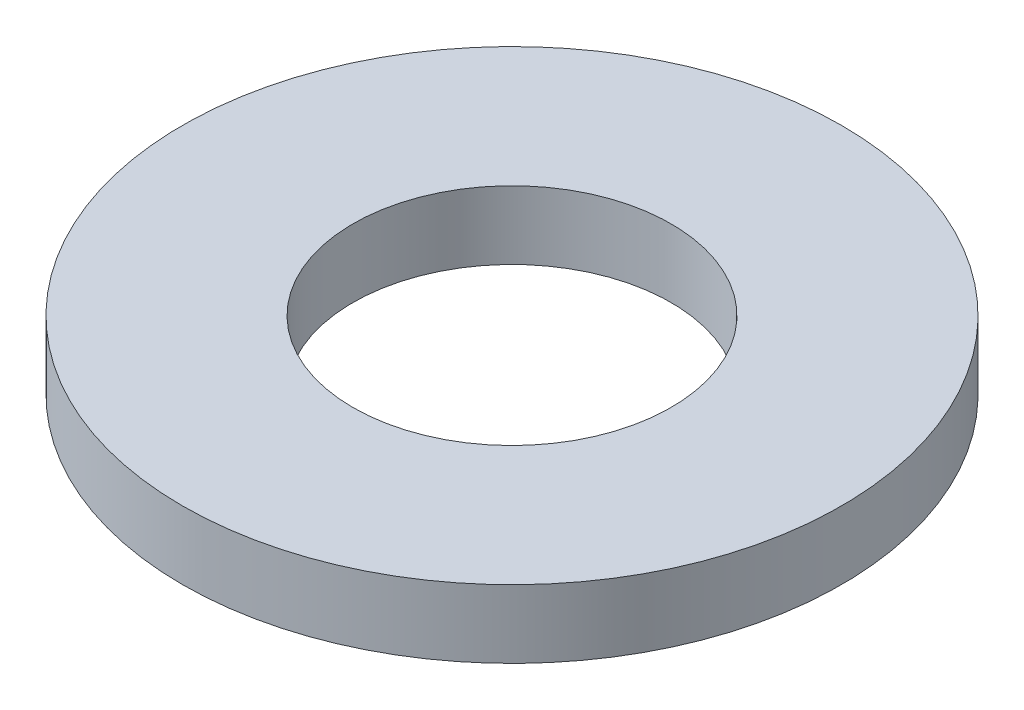
ISO-10303-21;
HEADER;
FILE_DESCRIPTION(('STEP AP214'),'2;1');
FILE_NAME('part.step','',(''),(''),'','','');
FILE_SCHEMA(('AUTOMOTIVE_DESIGN { 1 0 10303 214 1 1 1 1 }'));
ENDSEC;
DATA;
#1=APPLICATION_CONTEXT('core data for automotive mechanical design processes');
#2=APPLICATION_PROTOCOL_DEFINITION('international standard','automotive_design',2000,#1);
#3=PRODUCT_CONTEXT('',#1,'mechanical');
#4=PRODUCT('Part','Part','',(#3));
#5=PRODUCT_RELATED_PRODUCT_CATEGORY('part','',(#4));
#6=PRODUCT_DEFINITION_FORMATION('','',#4);
#7=PRODUCT_DEFINITION_CONTEXT('part definition',#1,'design');
#8=PRODUCT_DEFINITION('design','',#6,#7);
#9=PRODUCT_DEFINITION_SHAPE('','',#8);
#10=(LENGTH_UNIT() NAMED_UNIT(*) SI_UNIT(.MILLI.,.METRE.));
#11=(NAMED_UNIT(*) PLANE_ANGLE_UNIT() SI_UNIT($,.RADIAN.));
#12=(NAMED_UNIT(*) SI_UNIT($,.STERADIAN.) SOLID_ANGLE_UNIT());
#13=UNCERTAINTY_MEASURE_WITH_UNIT(LENGTH_MEASURE(1.E-05),#10,'distance_accuracy_value','');
#14=(GEOMETRIC_REPRESENTATION_CONTEXT(3) GLOBAL_UNCERTAINTY_ASSIGNED_CONTEXT((#13)) GLOBAL_UNIT_ASSIGNED_CONTEXT((#10,
#11,#12)) REPRESENTATION_CONTEXT('',''));
#15=CARTESIAN_POINT('',(0.,0.,0.));
#16=DIRECTION('',(0.,0.,1.));
#17=DIRECTION('',(1.,0.,0.));
#18=AXIS2_PLACEMENT_3D('',#15,#16,#17);
#19=CARTESIAN_POINT('',(0.,15.,0.));
#20=DIRECTION('',(0.,-1.,0.));
#21=DIRECTION('',(0.,0.,-1.));
#22=AXIS2_PLACEMENT_3D('',#19,#20,#21);
#23=CYLINDRICAL_SURFACE('',#22,72.5);
#24=CARTESIAN_POINT('',(0.,15.,0.));
#25=DIRECTION('',(0.,1.,0.));
#26=DIRECTION('',(0.,0.,1.));
#27=AXIS2_PLACEMENT_3D('',#24,#25,#26);
#28=CIRCLE('',#27,72.5);
#29=CARTESIAN_POINT('',(0.,15.,72.5));
#30=VERTEX_POINT('',#29);
#31=EDGE_CURVE('E10',#30,#30,#28,.T.);
#32=ORIENTED_EDGE('',*,*,#31,.F.);
#33=EDGE_LOOP('',(#32));
#34=FACE_BOUND('',#33,.T.);
#35=CARTESIAN_POINT('',(0.,0.,0.));
#36=DIRECTION('',(0.,1.,0.));
#37=DIRECTION('',(0.,0.,1.));
#38=AXIS2_PLACEMENT_3D('',#35,#36,#37);
#39=CIRCLE('',#38,72.5);
#40=CARTESIAN_POINT('',(0.,0.,72.5));
#41=VERTEX_POINT('',#40);
#42=EDGE_CURVE('E37',#41,#41,#39,.T.);
#43=ORIENTED_EDGE('',*,*,#42,.T.);
#44=EDGE_LOOP('',(#43));
#45=FACE_BOUND('',#44,.T.);
#46=ADVANCED_FACE('F40',(#34,#45),#23,.T.);
#47=CARTESIAN_POINT('',(0.,15.,0.));
#48=DIRECTION('',(0.,1.,0.));
#49=DIRECTION('',(0.,0.,1.));
#50=AXIS2_PLACEMENT_3D('',#47,#48,#49);
#51=PLANE('',#50);
#52=CARTESIAN_POINT('',(0.,15.,0.));
#53=DIRECTION('',(0.,1.,0.));
#54=DIRECTION('',(0.,0.,1.));
#55=AXIS2_PLACEMENT_3D('',#52,#53,#54);
#56=CIRCLE('',#55,35.);
#57=CARTESIAN_POINT('',(0.,15.,35.));
#58=VERTEX_POINT('',#57);
#59=EDGE_CURVE('E50',#58,#58,#56,.T.);
#60=ORIENTED_EDGE('',*,*,#59,.F.);
#61=EDGE_LOOP('',(#60));
#62=FACE_BOUND('',#61,.T.);
#63=ORIENTED_EDGE('',*,*,#31,.T.);
#64=EDGE_LOOP('',(#63));
#65=FACE_BOUND('',#64,.T.);
#66=ADVANCED_FACE('F59',(#62,#65),#51,.T.);
#67=CARTESIAN_POINT('',(0.,0.,0.));
#68=DIRECTION('',(0.,1.,0.));
#69=DIRECTION('',(0.,0.,1.));
#70=AXIS2_PLACEMENT_3D('',#67,#68,#69);
#71=PLANE('',#70);
#72=CARTESIAN_POINT('',(0.,0.,0.));
#73=DIRECTION('',(0.,1.,0.));
#74=DIRECTION('',(0.,0.,1.));
#75=AXIS2_PLACEMENT_3D('',#72,#73,#74);
#76=CIRCLE('',#75,35.);
#77=CARTESIAN_POINT('',(0.,0.,35.));
#78=VERTEX_POINT('',#77);
#79=EDGE_CURVE('E47',#78,#78,#76,.T.);
#80=ORIENTED_EDGE('',*,*,#79,.T.);
#81=EDGE_LOOP('',(#80));
#82=FACE_BOUND('',#81,.T.);
#83=ORIENTED_EDGE('',*,*,#42,.F.);
#84=EDGE_LOOP('',(#83));
#85=FACE_BOUND('',#84,.T.);
#86=ADVANCED_FACE('F58',(#82,#85),#71,.F.);
#87=CARTESIAN_POINT('',(0.,15.,0.));
#88=DIRECTION('',(0.,-1.,0.));
#89=DIRECTION('',(0.,0.,-1.));
#90=AXIS2_PLACEMENT_3D('',#87,#88,#89);
#91=CYLINDRICAL_SURFACE('',#90,35.);
#92=ORIENTED_EDGE('',*,*,#59,.T.);
#93=EDGE_LOOP('',(#92));
#94=FACE_BOUND('',#93,.T.);
#95=ORIENTED_EDGE('',*,*,#79,.F.);
#96=EDGE_LOOP('',(#95));
#97=FACE_BOUND('',#96,.T.);
#98=ADVANCED_FACE('F54',(#94,#97),#91,.F.);
#99=CLOSED_SHELL('',(#46,#66,#86,#98));
#100=MANIFOLD_SOLID_BREP('B2',#99);
#101=ADVANCED_BREP_SHAPE_REPRESENTATION('',(#18,#100),#14);
#102=SHAPE_DEFINITION_REPRESENTATION(#9,#101);
ENDSEC;
END-ISO-10303-21;
